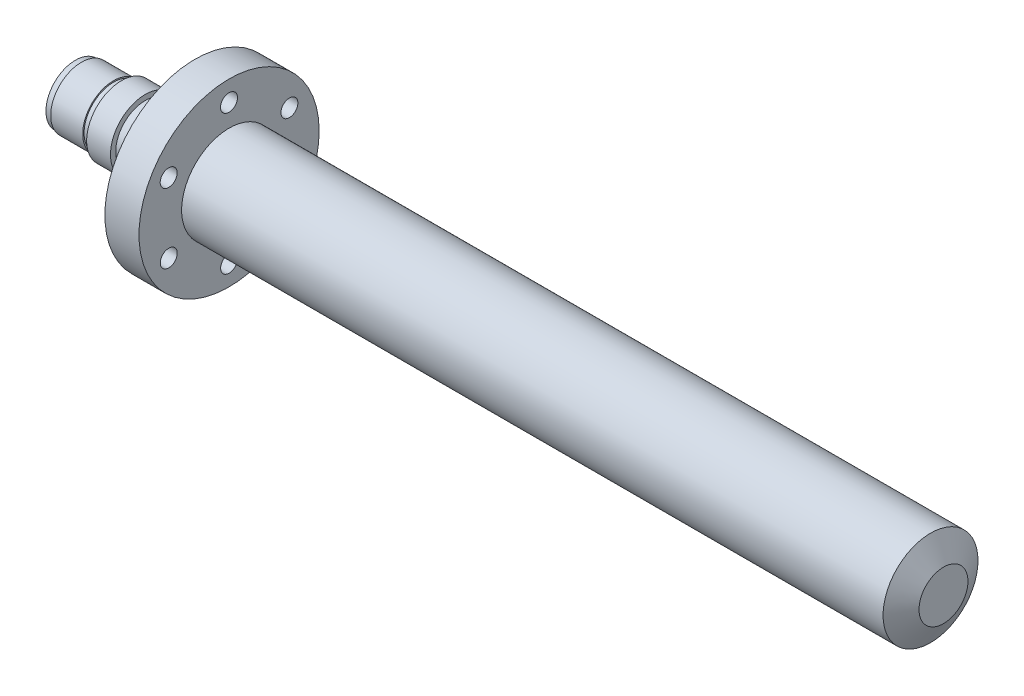
ISO-10303-21;
HEADER;
FILE_DESCRIPTION(('STEP AP214'),'2;1');
FILE_NAME('part.step','',(''),(''),'','','');
FILE_SCHEMA(('AUTOMOTIVE_DESIGN { 1 0 10303 214 1 1 1 1 }'));
ENDSEC;
DATA;
#1=APPLICATION_CONTEXT('core data for automotive mechanical design processes');
#2=APPLICATION_PROTOCOL_DEFINITION('international standard','automotive_design',2000,#1);
#3=PRODUCT_CONTEXT('',#1,'mechanical');
#4=PRODUCT('Part','Part','',(#3));
#5=PRODUCT_RELATED_PRODUCT_CATEGORY('part','',(#4));
#6=PRODUCT_DEFINITION_FORMATION('','',#4);
#7=PRODUCT_DEFINITION_CONTEXT('part definition',#1,'design');
#8=PRODUCT_DEFINITION('design','',#6,#7);
#9=PRODUCT_DEFINITION_SHAPE('','',#8);
#10=(LENGTH_UNIT() NAMED_UNIT(*) SI_UNIT(.MILLI.,.METRE.));
#11=(NAMED_UNIT(*) PLANE_ANGLE_UNIT() SI_UNIT($,.RADIAN.));
#12=(NAMED_UNIT(*) SI_UNIT($,.STERADIAN.) SOLID_ANGLE_UNIT());
#13=UNCERTAINTY_MEASURE_WITH_UNIT(LENGTH_MEASURE(1.E-05),#10,'distance_accuracy_value','');
#14=(GEOMETRIC_REPRESENTATION_CONTEXT(3) GLOBAL_UNCERTAINTY_ASSIGNED_CONTEXT((#13)) GLOBAL_UNIT_ASSIGNED_CONTEXT((#10,
#11,#12)) REPRESENTATION_CONTEXT('',''));
#15=CARTESIAN_POINT('',(0.,0.,0.));
#16=DIRECTION('',(0.,0.,1.));
#17=DIRECTION('',(1.,0.,0.));
#18=AXIS2_PLACEMENT_3D('',#15,#16,#17);
#19=CARTESIAN_POINT('',(-171.9443385333,0.,0.));
#20=DIRECTION('',(1.,0.,0.));
#21=DIRECTION('',(0.,0.,-1.));
#22=AXIS2_PLACEMENT_3D('',#19,#20,#21);
#23=CYLINDRICAL_SURFACE('',#22,11.66845134525);
#24=CARTESIAN_POINT('',(-171.9443385333,0.,0.));
#25=DIRECTION('',(1.,0.,0.));
#26=DIRECTION('',(0.,0.,-1.));
#27=AXIS2_PLACEMENT_3D('',#24,#25,#26);
#28=CIRCLE('',#27,11.66845134525);
#29=CARTESIAN_POINT('',(-171.9443385333,0.,-11.66845134525));
#30=VERTEX_POINT('',#29);
#31=EDGE_CURVE('E10',#30,#30,#28,.T.);
#32=ORIENTED_EDGE('',*,*,#31,.T.);
#33=EDGE_LOOP('',(#32));
#34=FACE_BOUND('',#33,.T.);
#35=CARTESIAN_POINT('',(-169.5345795433,0.,0.));
#36=DIRECTION('',(1.,0.,0.));
#37=DIRECTION('',(0.,0.,-1.));
#38=AXIS2_PLACEMENT_3D('',#35,#36,#37);
#39=CIRCLE('',#38,11.66845134525);
#40=CARTESIAN_POINT('',(-169.5345795433,0.,-11.66845134525));
#41=VERTEX_POINT('',#40);
#42=EDGE_CURVE('E89',#41,#41,#39,.T.);
#43=ORIENTED_EDGE('',*,*,#42,.F.);
#44=EDGE_LOOP('',(#43));
#45=FACE_BOUND('',#44,.T.);
#46=ADVANCED_FACE('F34',(#34,#45),#23,.T.);
#47=CARTESIAN_POINT('',(-171.9443385333,11.66845134525,0.));
#48=DIRECTION('',(-1.,0.,0.));
#49=DIRECTION('',(0.,0.,1.));
#50=AXIS2_PLACEMENT_3D('',#47,#48,#49);
#51=PLANE('',#50);
#52=ORIENTED_EDGE('',*,*,#31,.F.);
#53=EDGE_LOOP('',(#52));
#54=FACE_BOUND('',#53,.T.);
#55=ADVANCED_FACE('F177',(#54),#51,.T.);
#56=CARTESIAN_POINT('',(171.933426381501,0.,0.));
#57=DIRECTION('',(1.,0.,0.));
#58=DIRECTION('',(0.,0.,-1.));
#59=AXIS2_PLACEMENT_3D('',#56,#57,#58);
#60=PLANE('',#59);
#61=CARTESIAN_POINT('',(171.933426381502,0.,0.));
#62=DIRECTION('',(1.,0.,0.));
#63=DIRECTION('',(0.,0.,-1.));
#64=AXIS2_PLACEMENT_3D('',#61,#62,#63);
#65=CIRCLE('',#64,9.69427070819331);
#66=CARTESIAN_POINT('',(171.933426381502,0.,-9.69427070819331));
#67=VERTEX_POINT('',#66);
#68=EDGE_CURVE('E40',#67,#67,#65,.T.);
#69=ORIENTED_EDGE('',*,*,#68,.T.);
#70=EDGE_LOOP('',(#69));
#71=FACE_BOUND('',#70,.T.);
#72=ADVANCED_FACE('F172',(#71),#60,.T.);
#73=CARTESIAN_POINT('',(171.933426381502,0.,0.));
#74=DIRECTION('',(-1.,0.,0.));
#75=DIRECTION('',(0.,0.,1.));
#76=AXIS2_PLACEMENT_3D('',#73,#74,#75);
#77=CONICAL_SURFACE('',#76,9.69427070819331,1.05829137812021);
#78=CARTESIAN_POINT('',(166.8100692245,0.,0.));
#79=DIRECTION('',(1.,0.,0.));
#80=DIRECTION('',(0.,0.,-1.));
#81=AXIS2_PLACEMENT_3D('',#78,#79,#80);
#82=CIRCLE('',#81,18.8);
#83=CARTESIAN_POINT('',(166.8100692245,0.,-18.8));
#84=VERTEX_POINT('',#83);
#85=EDGE_CURVE('E44',#84,#84,#82,.T.);
#86=ORIENTED_EDGE('',*,*,#85,.T.);
#87=EDGE_LOOP('',(#86));
#88=FACE_BOUND('',#87,.T.);
#89=ORIENTED_EDGE('',*,*,#68,.F.);
#90=EDGE_LOOP('',(#89));
#91=FACE_BOUND('',#90,.T.);
#92=ADVANCED_FACE('F166',(#88,#91),#77,.T.);
#93=CARTESIAN_POINT('',(-171.9443385333,0.,0.));
#94=DIRECTION('',(1.,0.,0.));
#95=DIRECTION('',(0.,0.,-1.));
#96=AXIS2_PLACEMENT_3D('',#93,#94,#95);
#97=CYLINDRICAL_SURFACE('',#96,18.8);
#98=CARTESIAN_POINT('',(-111.0665739615,0.,0.));
#99=DIRECTION('',(1.,0.,0.));
#100=DIRECTION('',(0.,0.,-1.));
#101=AXIS2_PLACEMENT_3D('',#98,#99,#100);
#102=CIRCLE('',#101,18.8);
#103=CARTESIAN_POINT('',(-111.0665739615,0.,-18.8));
#104=VERTEX_POINT('',#103);
#105=EDGE_CURVE('E48',#104,#104,#102,.T.);
#106=ORIENTED_EDGE('',*,*,#105,.T.);
#107=EDGE_LOOP('',(#106));
#108=FACE_BOUND('',#107,.T.);
#109=ORIENTED_EDGE('',*,*,#85,.F.);
#110=EDGE_LOOP('',(#109));
#111=FACE_BOUND('',#110,.T.);
#112=ADVANCED_FACE('F159',(#108,#111),#97,.T.);
#113=CARTESIAN_POINT('',(-111.0665739615,18.8,0.));
#114=DIRECTION('',(1.,0.,0.));
#115=DIRECTION('',(0.,0.,-1.));
#116=AXIS2_PLACEMENT_3D('',#113,#114,#115);
#117=PLANE('',#116);
#118=CARTESIAN_POINT('',(-111.0665739615,13.8219231873056,-23.8965289923598));
#119=DIRECTION('',(1.,0.,0.));
#120=DIRECTION('',(0.,0.,-1.));
#121=AXIS2_PLACEMENT_3D('',#118,#119,#120);
#122=CIRCLE('',#121,3.3650047);
#123=CARTESIAN_POINT('',(-111.0665739615,13.8219231873056,-27.2615336923598));
#124=VERTEX_POINT('',#123);
#125=EDGE_CURVE('E122',#124,#124,#122,.T.);
#126=ORIENTED_EDGE('',*,*,#125,.F.);
#127=EDGE_LOOP('',(#126));
#128=FACE_BOUND('',#127,.T.);
#129=CARTESIAN_POINT('',(-111.0665739615,-13.7840395760022,-23.9184011055437));
#130=DIRECTION('',(1.,0.,0.));
#131=DIRECTION('',(0.,0.,-1.));
#132=AXIS2_PLACEMENT_3D('',#129,#130,#131);
#133=CIRCLE('',#132,3.3650047);
#134=CARTESIAN_POINT('',(-111.0665739615,-13.7840395760022,-27.2834058055437));
#135=VERTEX_POINT('',#134);
#136=EDGE_CURVE('E116',#135,#135,#133,.T.);
#137=ORIENTED_EDGE('',*,*,#136,.F.);
#138=EDGE_LOOP('',(#137));
#139=FACE_BOUND('',#138,.T.);
#140=CARTESIAN_POINT('',(-111.0665739615,-27.6059627633078,-0.021872113183615));
#141=DIRECTION('',(1.,0.,0.));
#142=DIRECTION('',(0.,0.,-1.));
#143=AXIS2_PLACEMENT_3D('',#140,#141,#142);
#144=CIRCLE('',#143,3.3650047);
#145=CARTESIAN_POINT('',(-111.0665739615,-27.6059627633078,-3.38687681318362));
#146=VERTEX_POINT('',#145);
#147=EDGE_CURVE('E110',#146,#146,#144,.T.);
#148=ORIENTED_EDGE('',*,*,#147,.F.);
#149=EDGE_LOOP('',(#148));
#150=FACE_BOUND('',#149,.T.);
#151=CARTESIAN_POINT('',(-111.0665739615,-13.8219231873055,23.8965289923599));
#152=DIRECTION('',(1.,0.,0.));
#153=DIRECTION('',(0.,0.,-1.));
#154=AXIS2_PLACEMENT_3D('',#151,#152,#153);
#155=CIRCLE('',#154,3.3650047);
#156=CARTESIAN_POINT('',(-111.0665739615,-13.8219231873055,20.5315242923599));
#157=VERTEX_POINT('',#156);
#158=EDGE_CURVE('E104',#157,#157,#155,.T.);
#159=ORIENTED_EDGE('',*,*,#158,.F.);
#160=EDGE_LOOP('',(#159));
#161=FACE_BOUND('',#160,.T.);
#162=CARTESIAN_POINT('',(-111.0665739615,13.7840395760024,23.9184011055436));
#163=DIRECTION('',(1.,0.,0.));
#164=DIRECTION('',(0.,0.,-1.));
#165=AXIS2_PLACEMENT_3D('',#162,#163,#164);
#166=CIRCLE('',#165,3.3650047);
#167=CARTESIAN_POINT('',(-111.0665739615,13.7840395760024,20.5533964055436));
#168=VERTEX_POINT('',#167);
#169=EDGE_CURVE('E98',#168,#168,#166,.T.);
#170=ORIENTED_EDGE('',*,*,#169,.F.);
#171=EDGE_LOOP('',(#170));
#172=FACE_BOUND('',#171,.T.);
#173=CARTESIAN_POINT('',(-111.0665739615,27.6059627633078,0.021872113183615));
#174=DIRECTION('',(1.,0.,0.));
#175=DIRECTION('',(0.,0.,-1.));
#176=AXIS2_PLACEMENT_3D('',#173,#174,#175);
#177=CIRCLE('',#176,3.3650047);
#178=CARTESIAN_POINT('',(-111.0665739615,27.6059627633078,-3.34313258681639));
#179=VERTEX_POINT('',#178);
#180=EDGE_CURVE('E92',#179,#179,#177,.T.);
#181=ORIENTED_EDGE('',*,*,#180,.F.);
#182=EDGE_LOOP('',(#181));
#183=FACE_BOUND('',#182,.T.);
#184=CARTESIAN_POINT('',(-111.0665739615,0.,0.));
#185=DIRECTION('',(1.,0.,0.));
#186=DIRECTION('',(0.,0.,-1.));
#187=AXIS2_PLACEMENT_3D('',#184,#185,#186);
#188=CIRCLE('',#187,35.6873775024);
#189=CARTESIAN_POINT('',(-111.0665739615,0.,-35.6873775024));
#190=VERTEX_POINT('',#189);
#191=EDGE_CURVE('E53',#190,#190,#188,.T.);
#192=ORIENTED_EDGE('',*,*,#191,.T.);
#193=EDGE_LOOP('',(#192));
#194=FACE_BOUND('',#193,.T.);
#195=ORIENTED_EDGE('',*,*,#105,.F.);
#196=EDGE_LOOP('',(#195));
#197=FACE_BOUND('',#196,.T.);
#198=ADVANCED_FACE('F153',(#128,#139,#150,#161,#172,#183,#194,#197),#117,.T.);
#199=CARTESIAN_POINT('',(-171.9443385333,0.,0.));
#200=DIRECTION('',(1.,0.,0.));
#201=DIRECTION('',(0.,0.,-1.));
#202=AXIS2_PLACEMENT_3D('',#199,#200,#201);
#203=CYLINDRICAL_SURFACE('',#202,35.6873775024);
#204=CARTESIAN_POINT('',(-124.5821787315,0.,0.));
#205=DIRECTION('',(1.,0.,0.));
#206=DIRECTION('',(0.,0.,-1.));
#207=AXIS2_PLACEMENT_3D('',#204,#205,#206);
#208=CIRCLE('',#207,35.6873775024);
#209=CARTESIAN_POINT('',(-124.5821787315,0.,-35.6873775024));
#210=VERTEX_POINT('',#209);
#211=EDGE_CURVE('E56',#210,#210,#208,.T.);
#212=ORIENTED_EDGE('',*,*,#211,.T.);
#213=EDGE_LOOP('',(#212));
#214=FACE_BOUND('',#213,.T.);
#215=ORIENTED_EDGE('',*,*,#191,.F.);
#216=EDGE_LOOP('',(#215));
#217=FACE_BOUND('',#216,.T.);
#218=ADVANCED_FACE('F135',(#214,#217),#203,.T.);
#219=CARTESIAN_POINT('',(-124.5821787315,35.6873775024,0.));
#220=DIRECTION('',(-1.,0.,0.));
#221=DIRECTION('',(0.,0.,1.));
#222=AXIS2_PLACEMENT_3D('',#219,#220,#221);
#223=PLANE('',#222);
#224=CARTESIAN_POINT('',(-124.5821787315,13.8219231873056,-23.8965289923598));
#225=DIRECTION('',(-1.,0.,0.));
#226=DIRECTION('',(0.,0.866025403784433,0.50000000000001));
#227=AXIS2_PLACEMENT_3D('',#224,#225,#226);
#228=CIRCLE('',#227,3.3650047);
#229=CARTESIAN_POINT('',(-124.5821787315,16.7361027413596,-22.2140266423598));
#230=VERTEX_POINT('',#229);
#231=EDGE_CURVE('E125',#230,#230,#228,.T.);
#232=ORIENTED_EDGE('',*,*,#231,.F.);
#233=EDGE_LOOP('',(#232));
#234=FACE_BOUND('',#233,.T.);
#235=CARTESIAN_POINT('',(-124.5821787315,-13.7840395760022,-23.9184011055437));
#236=DIRECTION('',(-1.,0.,0.));
#237=DIRECTION('',(0.,0.866025403784443,-0.499999999999992));
#238=AXIS2_PLACEMENT_3D('',#235,#236,#237);
#239=CIRCLE('',#238,3.3650047);
#240=CARTESIAN_POINT('',(-124.5821787315,-10.8698600219482,-25.6009034555437));
#241=VERTEX_POINT('',#240);
#242=EDGE_CURVE('E119',#241,#241,#239,.T.);
#243=ORIENTED_EDGE('',*,*,#242,.F.);
#244=EDGE_LOOP('',(#243));
#245=FACE_BOUND('',#244,.T.);
#246=CARTESIAN_POINT('',(-124.5821787315,-27.6059627633078,-0.021872113183615));
#247=DIRECTION('',(-1.,0.,0.));
#248=DIRECTION('',(0.,0.,-1.));
#249=AXIS2_PLACEMENT_3D('',#246,#247,#248);
#250=CIRCLE('',#249,3.3650047);
#251=CARTESIAN_POINT('',(-124.5821787315,-27.6059627633078,-3.38687681318362));
#252=VERTEX_POINT('',#251);
#253=EDGE_CURVE('E113',#252,#252,#250,.T.);
#254=ORIENTED_EDGE('',*,*,#253,.F.);
#255=EDGE_LOOP('',(#254));
#256=FACE_BOUND('',#255,.T.);
#257=CARTESIAN_POINT('',(-124.5821787315,-13.8219231873055,23.8965289923599));
#258=DIRECTION('',(-1.,0.,0.));
#259=DIRECTION('',(0.,-0.866025403784436,-0.500000000000004));
#260=AXIS2_PLACEMENT_3D('',#257,#258,#259);
#261=CIRCLE('',#260,3.3650047);
#262=CARTESIAN_POINT('',(-124.5821787315,-16.7361027413595,22.2140266423599));
#263=VERTEX_POINT('',#262);
#264=EDGE_CURVE('E107',#263,#263,#261,.T.);
#265=ORIENTED_EDGE('',*,*,#264,.F.);
#266=EDGE_LOOP('',(#265));
#267=FACE_BOUND('',#266,.T.);
#268=CARTESIAN_POINT('',(-124.5821787315,13.7840395760024,23.9184011055436));
#269=DIRECTION('',(-1.,0.,0.));
#270=DIRECTION('',(0.,-0.86602540378444,0.499999999999998));
#271=AXIS2_PLACEMENT_3D('',#268,#269,#270);
#272=CIRCLE('',#271,3.3650047);
#273=CARTESIAN_POINT('',(-124.5821787315,10.8698600219483,25.6009034555436));
#274=VERTEX_POINT('',#273);
#275=EDGE_CURVE('E101',#274,#274,#272,.T.);
#276=ORIENTED_EDGE('',*,*,#275,.F.);
#277=EDGE_LOOP('',(#276));
#278=FACE_BOUND('',#277,.T.);
#279=CARTESIAN_POINT('',(-124.5821787315,27.6059627633078,0.021872113183615));
#280=DIRECTION('',(-1.,0.,0.));
#281=DIRECTION('',(0.,0.,1.));
#282=AXIS2_PLACEMENT_3D('',#279,#280,#281);
#283=CIRCLE('',#282,3.3650047);
#284=CARTESIAN_POINT('',(-124.5821787315,27.6059627633078,3.38687681318362));
#285=VERTEX_POINT('',#284);
#286=EDGE_CURVE('E95',#285,#285,#283,.T.);
#287=ORIENTED_EDGE('',*,*,#286,.F.);
#288=EDGE_LOOP('',(#287));
#289=FACE_BOUND('',#288,.T.);
#290=CARTESIAN_POINT('',(-124.5821787315,0.,0.));
#291=DIRECTION('',(1.,0.,0.));
#292=DIRECTION('',(0.,0.,-1.));
#293=AXIS2_PLACEMENT_3D('',#290,#291,#292);
#294=CIRCLE('',#293,10.62073004525);
#295=CARTESIAN_POINT('',(-124.5821787315,0.,-10.62073004525));
#296=VERTEX_POINT('',#295);
#297=EDGE_CURVE('E59',#296,#296,#294,.T.);
#298=ORIENTED_EDGE('',*,*,#297,.T.);
#299=EDGE_LOOP('',(#298));
#300=FACE_BOUND('',#299,.T.);
#301=ORIENTED_EDGE('',*,*,#211,.F.);
#302=EDGE_LOOP('',(#301));
#303=FACE_BOUND('',#302,.T.);
#304=ADVANCED_FACE('F131',(#234,#245,#256,#267,#278,#289,#300,#303),#223,.T.);
#305=CARTESIAN_POINT('',(-171.9443385333,0.,0.));
#306=DIRECTION('',(1.,0.,0.));
#307=DIRECTION('',(0.,0.,-1.));
#308=AXIS2_PLACEMENT_3D('',#305,#306,#307);
#309=CYLINDRICAL_SURFACE('',#308,10.62073004525);
#310=CARTESIAN_POINT('',(-139.4649782333,0.,0.));
#311=DIRECTION('',(1.,0.,0.));
#312=DIRECTION('',(0.,0.,-1.));
#313=AXIS2_PLACEMENT_3D('',#310,#311,#312);
#314=CIRCLE('',#313,10.62073004525);
#315=CARTESIAN_POINT('',(-139.4649782333,0.,-10.62073004525));
#316=VERTEX_POINT('',#315);
#317=EDGE_CURVE('E62',#316,#316,#314,.T.);
#318=ORIENTED_EDGE('',*,*,#317,.T.);
#319=EDGE_LOOP('',(#318));
#320=FACE_BOUND('',#319,.T.);
#321=ORIENTED_EDGE('',*,*,#297,.F.);
#322=EDGE_LOOP('',(#321));
#323=FACE_BOUND('',#322,.T.);
#324=ADVANCED_FACE('F134',(#320,#323),#309,.T.);
#325=CARTESIAN_POINT('',(-139.4649782333,10.62073004525,0.));
#326=DIRECTION('',(1.,0.,0.));
#327=DIRECTION('',(0.,0.,-1.));
#328=AXIS2_PLACEMENT_3D('',#325,#326,#327);
#329=PLANE('',#328);
#330=CARTESIAN_POINT('',(-139.4649782333,0.,0.));
#331=DIRECTION('',(1.,0.,0.));
#332=DIRECTION('',(0.,0.,-1.));
#333=AXIS2_PLACEMENT_3D('',#330,#331,#332);
#334=CIRCLE('',#333,11.66845134525);
#335=CARTESIAN_POINT('',(-139.4649782333,0.,-11.66845134525));
#336=VERTEX_POINT('',#335);
#337=EDGE_CURVE('E65',#336,#336,#334,.T.);
#338=ORIENTED_EDGE('',*,*,#337,.T.);
#339=EDGE_LOOP('',(#338));
#340=FACE_BOUND('',#339,.T.);
#341=ORIENTED_EDGE('',*,*,#317,.F.);
#342=EDGE_LOOP('',(#341));
#343=FACE_BOUND('',#342,.T.);
#344=ADVANCED_FACE('F233',(#340,#343),#329,.T.);
#345=CARTESIAN_POINT('',(-171.9443385333,0.,0.));
#346=DIRECTION('',(1.,0.,0.));
#347=DIRECTION('',(0.,0.,-1.));
#348=AXIS2_PLACEMENT_3D('',#345,#346,#347);
#349=CYLINDRICAL_SURFACE('',#348,11.66845134525);
#350=CARTESIAN_POINT('',(-144.2844962133,0.,0.));
#351=DIRECTION('',(1.,0.,0.));
#352=DIRECTION('',(0.,0.,-1.));
#353=AXIS2_PLACEMENT_3D('',#350,#351,#352);
#354=CIRCLE('',#353,11.66845134525);
#355=CARTESIAN_POINT('',(-144.2844962133,0.,-11.66845134525));
#356=VERTEX_POINT('',#355);
#357=EDGE_CURVE('E68',#356,#356,#354,.T.);
#358=ORIENTED_EDGE('',*,*,#357,.T.);
#359=EDGE_LOOP('',(#358));
#360=FACE_BOUND('',#359,.T.);
#361=ORIENTED_EDGE('',*,*,#337,.F.);
#362=EDGE_LOOP('',(#361));
#363=FACE_BOUND('',#362,.T.);
#364=ADVANCED_FACE('F227',(#360,#363),#349,.T.);
#365=CARTESIAN_POINT('',(-144.2844962133,11.66845134525,0.));
#366=DIRECTION('',(1.,0.,0.));
#367=DIRECTION('',(0.,0.,-1.));
#368=AXIS2_PLACEMENT_3D('',#365,#366,#367);
#369=PLANE('',#368);
#370=CARTESIAN_POINT('',(-144.2844962133,0.,0.));
#371=DIRECTION('',(1.,0.,0.));
#372=DIRECTION('',(0.,0.,-1.));
#373=AXIS2_PLACEMENT_3D('',#370,#371,#372);
#374=CIRCLE('',#373,13.76389394525);
#375=CARTESIAN_POINT('',(-144.2844962133,0.,-13.76389394525));
#376=VERTEX_POINT('',#375);
#377=EDGE_CURVE('E71',#376,#376,#374,.T.);
#378=ORIENTED_EDGE('',*,*,#377,.T.);
#379=EDGE_LOOP('',(#378));
#380=FACE_BOUND('',#379,.T.);
#381=ORIENTED_EDGE('',*,*,#357,.F.);
#382=EDGE_LOOP('',(#381));
#383=FACE_BOUND('',#382,.T.);
#384=ADVANCED_FACE('F221',(#380,#383),#369,.T.);
#385=CARTESIAN_POINT('',(-171.9443385333,0.,0.));
#386=DIRECTION('',(1.,0.,0.));
#387=DIRECTION('',(0.,0.,-1.));
#388=AXIS2_PLACEMENT_3D('',#385,#386,#387);
#389=CYLINDRICAL_SURFACE('',#388,13.76389394525);
#390=CARTESIAN_POINT('',(-153.7139879133,0.,0.));
#391=DIRECTION('',(1.,0.,0.));
#392=DIRECTION('',(0.,0.,-1.));
#393=AXIS2_PLACEMENT_3D('',#390,#391,#392);
#394=CIRCLE('',#393,13.76389394525);
#395=CARTESIAN_POINT('',(-153.7139879133,0.,-13.76389394525));
#396=VERTEX_POINT('',#395);
#397=EDGE_CURVE('E74',#396,#396,#394,.T.);
#398=ORIENTED_EDGE('',*,*,#397,.T.);
#399=EDGE_LOOP('',(#398));
#400=FACE_BOUND('',#399,.T.);
#401=ORIENTED_EDGE('',*,*,#377,.F.);
#402=EDGE_LOOP('',(#401));
#403=FACE_BOUND('',#402,.T.);
#404=ADVANCED_FACE('F215',(#400,#403),#389,.T.);
#405=CARTESIAN_POINT('',(-153.7139879133,13.76389394525,0.));
#406=DIRECTION('',(-1.,0.,0.));
#407=DIRECTION('',(0.,0.,1.));
#408=AXIS2_PLACEMENT_3D('',#405,#406,#407);
#409=PLANE('',#408);
#410=CARTESIAN_POINT('',(-153.7139879133,0.,0.));
#411=DIRECTION('',(1.,0.,0.));
#412=DIRECTION('',(0.,0.,-1.));
#413=AXIS2_PLACEMENT_3D('',#410,#411,#412);
#414=CIRCLE('',#413,11.66845134525);
#415=CARTESIAN_POINT('',(-153.7139879133,0.,-11.66845134525));
#416=VERTEX_POINT('',#415);
#417=EDGE_CURVE('E77',#416,#416,#414,.T.);
#418=ORIENTED_EDGE('',*,*,#417,.T.);
#419=EDGE_LOOP('',(#418));
#420=FACE_BOUND('',#419,.T.);
#421=ORIENTED_EDGE('',*,*,#397,.F.);
#422=EDGE_LOOP('',(#421));
#423=FACE_BOUND('',#422,.T.);
#424=ADVANCED_FACE('F209',(#420,#423),#409,.T.);
#425=CARTESIAN_POINT('',(-171.9443385333,0.,0.));
#426=DIRECTION('',(1.,0.,0.));
#427=DIRECTION('',(0.,0.,-1.));
#428=AXIS2_PLACEMENT_3D('',#425,#426,#427);
#429=CYLINDRICAL_SURFACE('',#428,11.66845134525);
#430=CARTESIAN_POINT('',(-156.8571518133,0.,0.));
#431=DIRECTION('',(1.,0.,0.));
#432=DIRECTION('',(0.,0.,-1.));
#433=AXIS2_PLACEMENT_3D('',#430,#431,#432);
#434=CIRCLE('',#433,11.66845134525);
#435=CARTESIAN_POINT('',(-156.8571518133,0.,-11.66845134525));
#436=VERTEX_POINT('',#435);
#437=EDGE_CURVE('E80',#436,#436,#434,.T.);
#438=ORIENTED_EDGE('',*,*,#437,.T.);
#439=EDGE_LOOP('',(#438));
#440=FACE_BOUND('',#439,.T.);
#441=ORIENTED_EDGE('',*,*,#417,.F.);
#442=EDGE_LOOP('',(#441));
#443=FACE_BOUND('',#442,.T.);
#444=ADVANCED_FACE('F203',(#440,#443),#429,.T.);
#445=CARTESIAN_POINT('',(-156.8571518133,11.66845134525,0.));
#446=DIRECTION('',(1.,0.,0.));
#447=DIRECTION('',(0.,0.,-1.));
#448=AXIS2_PLACEMENT_3D('',#445,#446,#447);
#449=PLANE('',#448);
#450=CARTESIAN_POINT('',(-156.8571518133,0.,0.));
#451=DIRECTION('',(1.,0.,0.));
#452=DIRECTION('',(0.,0.,-1.));
#453=AXIS2_PLACEMENT_3D('',#450,#451,#452);
#454=CIRCLE('',#453,12.19231199525);
#455=CARTESIAN_POINT('',(-156.8571518133,0.,-12.19231199525));
#456=VERTEX_POINT('',#455);
#457=EDGE_CURVE('E83',#456,#456,#454,.T.);
#458=ORIENTED_EDGE('',*,*,#457,.T.);
#459=EDGE_LOOP('',(#458));
#460=FACE_BOUND('',#459,.T.);
#461=ORIENTED_EDGE('',*,*,#437,.F.);
#462=EDGE_LOOP('',(#461));
#463=FACE_BOUND('',#462,.T.);
#464=ADVANCED_FACE('F197',(#460,#463),#449,.T.);
#465=CARTESIAN_POINT('',(-171.9443385333,0.,0.));
#466=DIRECTION('',(1.,0.,0.));
#467=DIRECTION('',(0.,0.,-1.));
#468=AXIS2_PLACEMENT_3D('',#465,#466,#467);
#469=CYLINDRICAL_SURFACE('',#468,12.19231199525);
#470=CARTESIAN_POINT('',(-169.5345795433,0.,0.));
#471=DIRECTION('',(1.,0.,0.));
#472=DIRECTION('',(0.,0.,-1.));
#473=AXIS2_PLACEMENT_3D('',#470,#471,#472);
#474=CIRCLE('',#473,12.19231199525);
#475=CARTESIAN_POINT('',(-169.5345795433,0.,-12.19231199525));
#476=VERTEX_POINT('',#475);
#477=EDGE_CURVE('E86',#476,#476,#474,.T.);
#478=ORIENTED_EDGE('',*,*,#477,.T.);
#479=EDGE_LOOP('',(#478));
#480=FACE_BOUND('',#479,.T.);
#481=ORIENTED_EDGE('',*,*,#457,.F.);
#482=EDGE_LOOP('',(#481));
#483=FACE_BOUND('',#482,.T.);
#484=ADVANCED_FACE('F191',(#480,#483),#469,.T.);
#485=CARTESIAN_POINT('',(-169.5345795433,12.19231199525,0.));
#486=DIRECTION('',(-1.,0.,0.));
#487=DIRECTION('',(0.,0.,1.));
#488=AXIS2_PLACEMENT_3D('',#485,#486,#487);
#489=PLANE('',#488);
#490=ORIENTED_EDGE('',*,*,#42,.T.);
#491=EDGE_LOOP('',(#490));
#492=FACE_BOUND('',#491,.T.);
#493=ORIENTED_EDGE('',*,*,#477,.F.);
#494=EDGE_LOOP('',(#493));
#495=FACE_BOUND('',#494,.T.);
#496=ADVANCED_FACE('F187',(#492,#495),#489,.T.);
#497=CARTESIAN_POINT('',(-5.20217873149996,27.6059627633078,0.021872113183615));
#498=DIRECTION('',(-1.,0.,0.));
#499=DIRECTION('',(0.,0.,1.));
#500=AXIS2_PLACEMENT_3D('',#497,#498,#499);
#501=CYLINDRICAL_SURFACE('',#500,3.3650047);
#502=ORIENTED_EDGE('',*,*,#180,.T.);
#503=EDGE_LOOP('',(#502));
#504=FACE_BOUND('',#503,.T.);
#505=ORIENTED_EDGE('',*,*,#286,.T.);
#506=EDGE_LOOP('',(#505));
#507=FACE_BOUND('',#506,.T.);
#508=ADVANCED_FACE('F190',(#504,#507),#501,.F.);
#509=CARTESIAN_POINT('',(-5.20217873149996,13.7840395760024,23.9184011055436));
#510=DIRECTION('',(-1.,0.,0.));
#511=DIRECTION('',(0.,0.,1.));
#512=AXIS2_PLACEMENT_3D('',#509,#510,#511);
#513=CYLINDRICAL_SURFACE('',#512,3.3650047);
#514=ORIENTED_EDGE('',*,*,#169,.T.);
#515=EDGE_LOOP('',(#514));
#516=FACE_BOUND('',#515,.T.);
#517=ORIENTED_EDGE('',*,*,#275,.T.);
#518=EDGE_LOOP('',(#517));
#519=FACE_BOUND('',#518,.T.);
#520=ADVANCED_FACE('F250',(#516,#519),#513,.F.);
#521=CARTESIAN_POINT('',(-5.20217873149996,-13.8219231873055,23.8965289923599));
#522=DIRECTION('',(-1.,0.,0.));
#523=DIRECTION('',(0.,0.,1.));
#524=AXIS2_PLACEMENT_3D('',#521,#522,#523);
#525=CYLINDRICAL_SURFACE('',#524,3.3650047);
#526=ORIENTED_EDGE('',*,*,#158,.T.);
#527=EDGE_LOOP('',(#526));
#528=FACE_BOUND('',#527,.T.);
#529=ORIENTED_EDGE('',*,*,#264,.T.);
#530=EDGE_LOOP('',(#529));
#531=FACE_BOUND('',#530,.T.);
#532=ADVANCED_FACE('F254',(#528,#531),#525,.F.);
#533=CARTESIAN_POINT('',(-5.20217873149996,-27.6059627633078,-0.021872113183615));
#534=DIRECTION('',(-1.,0.,0.));
#535=DIRECTION('',(0.,0.,1.));
#536=AXIS2_PLACEMENT_3D('',#533,#534,#535);
#537=CYLINDRICAL_SURFACE('',#536,3.3650047);
#538=ORIENTED_EDGE('',*,*,#147,.T.);
#539=EDGE_LOOP('',(#538));
#540=FACE_BOUND('',#539,.T.);
#541=ORIENTED_EDGE('',*,*,#253,.T.);
#542=EDGE_LOOP('',(#541));
#543=FACE_BOUND('',#542,.T.);
#544=ADVANCED_FACE('F258',(#540,#543),#537,.F.);
#545=CARTESIAN_POINT('',(-5.20217873149996,-13.7840395760022,-23.9184011055437));
#546=DIRECTION('',(-1.,0.,0.));
#547=DIRECTION('',(0.,0.,1.));
#548=AXIS2_PLACEMENT_3D('',#545,#546,#547);
#549=CYLINDRICAL_SURFACE('',#548,3.3650047);
#550=ORIENTED_EDGE('',*,*,#136,.T.);
#551=EDGE_LOOP('',(#550));
#552=FACE_BOUND('',#551,.T.);
#553=ORIENTED_EDGE('',*,*,#242,.T.);
#554=EDGE_LOOP('',(#553));
#555=FACE_BOUND('',#554,.T.);
#556=ADVANCED_FACE('F262',(#552,#555),#549,.F.);
#557=CARTESIAN_POINT('',(-5.20217873149996,13.8219231873056,-23.8965289923598));
#558=DIRECTION('',(-1.,0.,0.));
#559=DIRECTION('',(0.,0.,1.));
#560=AXIS2_PLACEMENT_3D('',#557,#558,#559);
#561=CYLINDRICAL_SURFACE('',#560,3.3650047);
#562=ORIENTED_EDGE('',*,*,#125,.T.);
#563=EDGE_LOOP('',(#562));
#564=FACE_BOUND('',#563,.T.);
#565=ORIENTED_EDGE('',*,*,#231,.T.);
#566=EDGE_LOOP('',(#565));
#567=FACE_BOUND('',#566,.T.);
#568=ADVANCED_FACE('F129',(#564,#567),#561,.F.);
#569=CLOSED_SHELL('',(#46,#55,#72,#92,#112,#198,#218,#304,#324,#344,#364,#384,#404,#424,#444,
#464,#484,#496,#508,#520,#532,#544,#556,#568));
#570=MANIFOLD_SOLID_BREP('B2',#569);
#571=ADVANCED_BREP_SHAPE_REPRESENTATION('',(#18,#570),#14);
#572=SHAPE_DEFINITION_REPRESENTATION(#9,#571);
ENDSEC;
END-ISO-10303-21;
